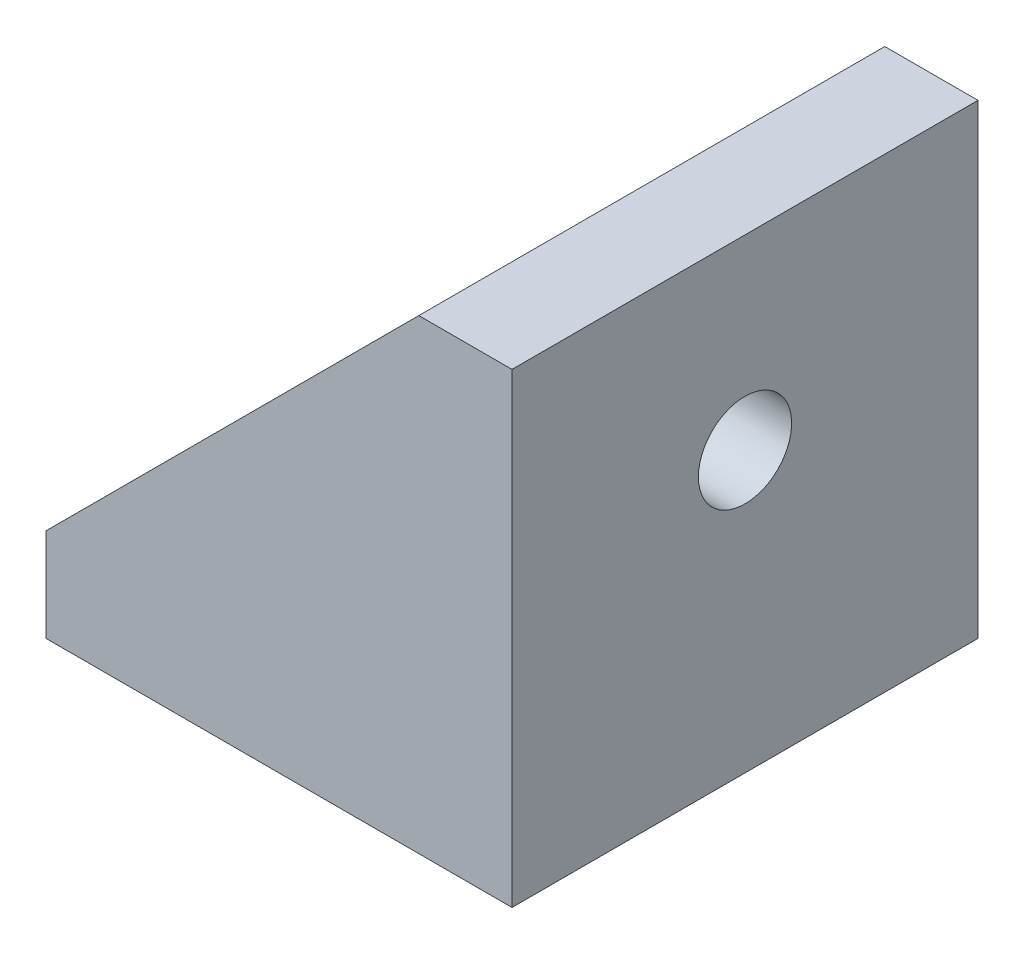
ISO-10303-21;
HEADER;
FILE_DESCRIPTION(('STEP AP214'),'2;1');
FILE_NAME('part.step','',(''),(''),'','','');
FILE_SCHEMA(('AUTOMOTIVE_DESIGN { 1 0 10303 214 1 1 1 1 }'));
ENDSEC;
DATA;
#1=APPLICATION_CONTEXT('core data for automotive mechanical design processes');
#2=APPLICATION_PROTOCOL_DEFINITION('international standard','automotive_design',2000,#1);
#3=PRODUCT_CONTEXT('',#1,'mechanical');
#4=PRODUCT('Part','Part','',(#3));
#5=PRODUCT_RELATED_PRODUCT_CATEGORY('part','',(#4));
#6=PRODUCT_DEFINITION_FORMATION('','',#4);
#7=PRODUCT_DEFINITION_CONTEXT('part definition',#1,'design');
#8=PRODUCT_DEFINITION('design','',#6,#7);
#9=PRODUCT_DEFINITION_SHAPE('','',#8);
#10=(LENGTH_UNIT() NAMED_UNIT(*) SI_UNIT(.MILLI.,.METRE.));
#11=(NAMED_UNIT(*) PLANE_ANGLE_UNIT() SI_UNIT($,.RADIAN.));
#12=(NAMED_UNIT(*) SI_UNIT($,.STERADIAN.) SOLID_ANGLE_UNIT());
#13=UNCERTAINTY_MEASURE_WITH_UNIT(LENGTH_MEASURE(1.E-05),#10,'distance_accuracy_value','');
#14=(GEOMETRIC_REPRESENTATION_CONTEXT(3) GLOBAL_UNCERTAINTY_ASSIGNED_CONTEXT((#13)) GLOBAL_UNIT_ASSIGNED_CONTEXT((#10,
#11,#12)) REPRESENTATION_CONTEXT('',''));
#15=CARTESIAN_POINT('',(0.,0.,0.));
#16=DIRECTION('',(0.,0.,1.));
#17=DIRECTION('',(1.,0.,0.));
#18=AXIS2_PLACEMENT_3D('',#15,#16,#17);
#19=CARTESIAN_POINT('',(-4.,4.,20.));
#20=DIRECTION('',(1.,0.,0.));
#21=DIRECTION('',(0.,0.,-1.));
#22=AXIS2_PLACEMENT_3D('',#19,#20,#21);
#23=PLANE('',#22);
#24=CARTESIAN_POINT('',(-4.,12.,10.));
#25=DIRECTION('',(-1.,0.,0.));
#26=DIRECTION('',(0.,0.,1.));
#27=AXIS2_PLACEMENT_3D('',#24,#25,#26);
#28=CIRCLE('',#27,2.);
#29=CARTESIAN_POINT('',(-4.,12.,12.));
#30=VERTEX_POINT('',#29);
#31=EDGE_CURVE('E173',#30,#30,#28,.T.);
#32=ORIENTED_EDGE('',*,*,#31,.F.);
#33=EDGE_LOOP('',(#32));
#34=FACE_BOUND('',#33,.T.);
#35=DIRECTION('',(0.,0.,-1.));
#36=VECTOR('',#35,1.);
#37=CARTESIAN_POINT('',(-4.,4.,20.));
#38=LINE('',#37,#36);
#39=CARTESIAN_POINT('',(-4.,4.,16.));
#40=VERTEX_POINT('',#39);
#41=CARTESIAN_POINT('',(-4.,4.,4.));
#42=VERTEX_POINT('',#41);
#43=EDGE_CURVE('E57',#40,#42,#38,.T.);
#44=ORIENTED_EDGE('',*,*,#43,.F.);
#45=DIRECTION('',(0.,1.,0.));
#46=VECTOR('',#45,1.);
#47=CARTESIAN_POINT('',(-4.,4.,16.));
#48=LINE('',#47,#46);
#49=CARTESIAN_POINT('',(-4.,20.,16.));
#50=VERTEX_POINT('',#49);
#51=EDGE_CURVE('E111',#40,#50,#48,.T.);
#52=ORIENTED_EDGE('',*,*,#51,.T.);
#53=DIRECTION('',(0.,0.,-1.));
#54=VECTOR('',#53,1.);
#55=CARTESIAN_POINT('',(-4.,20.,20.));
#56=LINE('',#55,#54);
#57=CARTESIAN_POINT('',(-4.,20.,4.));
#58=VERTEX_POINT('',#57);
#59=EDGE_CURVE('E49',#50,#58,#56,.T.);
#60=ORIENTED_EDGE('',*,*,#59,.T.);
#61=DIRECTION('',(0.,-1.,0.));
#62=VECTOR('',#61,1.);
#63=CARTESIAN_POINT('',(-4.,4.,4.));
#64=LINE('',#63,#62);
#65=EDGE_CURVE('E158',#58,#42,#64,.T.);
#66=ORIENTED_EDGE('',*,*,#65,.T.);
#67=EDGE_LOOP('',(#44,#52,#60,#66));
#68=FACE_BOUND('',#67,.T.);
#69=ADVANCED_FACE('F34',(#34,#68),#23,.F.);
#70=CARTESIAN_POINT('',(-20.,4.,20.));
#71=DIRECTION('',(0.,-1.,0.));
#72=DIRECTION('',(0.,0.,-1.));
#73=AXIS2_PLACEMENT_3D('',#70,#71,#72);
#74=PLANE('',#73);
#75=CARTESIAN_POINT('',(-12.,4.,10.));
#76=DIRECTION('',(0.,1.,0.));
#77=DIRECTION('',(0.,0.,1.));
#78=AXIS2_PLACEMENT_3D('',#75,#76,#77);
#79=CIRCLE('',#78,2.);
#80=CARTESIAN_POINT('',(-12.,4.,12.));
#81=VERTEX_POINT('',#80);
#82=EDGE_CURVE('E167',#81,#81,#79,.T.);
#83=ORIENTED_EDGE('',*,*,#82,.F.);
#84=EDGE_LOOP('',(#83));
#85=FACE_BOUND('',#84,.T.);
#86=DIRECTION('',(0.,0.,-1.));
#87=VECTOR('',#86,1.);
#88=CARTESIAN_POINT('',(-20.,4.,20.));
#89=LINE('',#88,#87);
#90=CARTESIAN_POINT('',(-20.,4.,16.));
#91=VERTEX_POINT('',#90);
#92=CARTESIAN_POINT('',(-20.,4.,4.));
#93=VERTEX_POINT('',#92);
#94=EDGE_CURVE('E125',#91,#93,#89,.T.);
#95=ORIENTED_EDGE('',*,*,#94,.F.);
#96=DIRECTION('',(1.,0.,0.));
#97=VECTOR('',#96,1.);
#98=CARTESIAN_POINT('',(-20.,4.,16.));
#99=LINE('',#98,#97);
#100=EDGE_CURVE('E112',#91,#40,#99,.T.);
#101=ORIENTED_EDGE('',*,*,#100,.T.);
#102=ORIENTED_EDGE('',*,*,#43,.T.);
#103=DIRECTION('',(-1.,0.,0.));
#104=VECTOR('',#103,1.);
#105=CARTESIAN_POINT('',(-20.,4.,4.));
#106=LINE('',#105,#104);
#107=EDGE_CURVE('E161',#42,#93,#106,.T.);
#108=ORIENTED_EDGE('',*,*,#107,.T.);
#109=EDGE_LOOP('',(#95,#101,#102,#108));
#110=FACE_BOUND('',#109,.T.);
#111=ADVANCED_FACE('F189',(#85,#110),#74,.F.);
#112=CARTESIAN_POINT('',(0.,20.,20.));
#113=DIRECTION('',(-1.,0.,0.));
#114=DIRECTION('',(0.,0.,1.));
#115=AXIS2_PLACEMENT_3D('',#112,#113,#114);
#116=PLANE('',#115);
#117=CARTESIAN_POINT('',(0.,12.,10.));
#118=DIRECTION('',(-1.,0.,0.));
#119=DIRECTION('',(0.,0.,1.));
#120=AXIS2_PLACEMENT_3D('',#117,#118,#119);
#121=CIRCLE('',#120,2.);
#122=CARTESIAN_POINT('',(0.,12.,12.));
#123=VERTEX_POINT('',#122);
#124=EDGE_CURVE('E170',#123,#123,#121,.T.);
#125=ORIENTED_EDGE('',*,*,#124,.T.);
#126=EDGE_LOOP('',(#125));
#127=FACE_BOUND('',#126,.T.);
#128=DIRECTION('',(0.,1.,0.));
#129=VECTOR('',#128,1.);
#130=CARTESIAN_POINT('',(0.,20.,0.));
#131=LINE('',#130,#129);
#132=CARTESIAN_POINT('',(0.,0.,0.));
#133=VERTEX_POINT('',#132);
#134=CARTESIAN_POINT('',(0.,20.,0.));
#135=VERTEX_POINT('',#134);
#136=EDGE_CURVE('E140',#133,#135,#131,.T.);
#137=ORIENTED_EDGE('',*,*,#136,.T.);
#138=DIRECTION('',(0.,0.,-1.));
#139=VECTOR('',#138,1.);
#140=CARTESIAN_POINT('',(0.,20.,20.));
#141=LINE('',#140,#139);
#142=CARTESIAN_POINT('',(0.,20.,20.));
#143=VERTEX_POINT('',#142);
#144=EDGE_CURVE('E11',#143,#135,#141,.T.);
#145=ORIENTED_EDGE('',*,*,#144,.F.);
#146=DIRECTION('',(0.,1.,0.));
#147=VECTOR('',#146,1.);
#148=CARTESIAN_POINT('',(0.,20.,20.));
#149=LINE('',#148,#147);
#150=CARTESIAN_POINT('',(0.,0.,20.));
#151=VERTEX_POINT('',#150);
#152=EDGE_CURVE('E135',#151,#143,#149,.T.);
#153=ORIENTED_EDGE('',*,*,#152,.F.);
#154=DIRECTION('',(0.,0.,-1.));
#155=VECTOR('',#154,1.);
#156=CARTESIAN_POINT('',(0.,0.,20.));
#157=LINE('',#156,#155);
#158=EDGE_CURVE('E129',#151,#133,#157,.T.);
#159=ORIENTED_EDGE('',*,*,#158,.T.);
#160=EDGE_LOOP('',(#137,#145,#153,#159));
#161=FACE_BOUND('',#160,.T.);
#162=ADVANCED_FACE('F36',(#127,#161),#116,.F.);
#163=CARTESIAN_POINT('',(-4.,20.,20.));
#164=DIRECTION('',(0.,-1.,0.));
#165=DIRECTION('',(0.,0.,-1.));
#166=AXIS2_PLACEMENT_3D('',#163,#164,#165);
#167=PLANE('',#166);
#168=DIRECTION('',(-1.,0.,0.));
#169=VECTOR('',#168,1.);
#170=CARTESIAN_POINT('',(-4.,20.,0.));
#171=LINE('',#170,#169);
#172=CARTESIAN_POINT('',(-4.,20.,0.));
#173=VERTEX_POINT('',#172);
#174=EDGE_CURVE('E138',#135,#173,#171,.T.);
#175=ORIENTED_EDGE('',*,*,#174,.T.);
#176=DIRECTION('',(0.,0.,-1.));
#177=VECTOR('',#176,1.);
#178=CARTESIAN_POINT('',(-4.,20.,4.));
#179=LINE('',#178,#177);
#180=EDGE_CURVE('E118',#58,#173,#179,.T.);
#181=ORIENTED_EDGE('',*,*,#180,.F.);
#182=ORIENTED_EDGE('',*,*,#59,.F.);
#183=CARTESIAN_POINT('',(-4.,20.,20.));
#184=VERTEX_POINT('',#183);
#185=EDGE_CURVE('E42',#184,#50,#56,.T.);
#186=ORIENTED_EDGE('',*,*,#185,.F.);
#187=DIRECTION('',(-1.,0.,0.));
#188=VECTOR('',#187,1.);
#189=CARTESIAN_POINT('',(-4.,20.,20.));
#190=LINE('',#189,#188);
#191=EDGE_CURVE('E146',#143,#184,#190,.T.);
#192=ORIENTED_EDGE('',*,*,#191,.F.);
#193=ORIENTED_EDGE('',*,*,#144,.T.);
#194=EDGE_LOOP('',(#175,#181,#182,#186,#192,#193));
#195=FACE_BOUND('',#194,.T.);
#196=ADVANCED_FACE('F116',(#195),#167,.F.);
#197=CARTESIAN_POINT('',(-20.,0.,20.));
#198=DIRECTION('',(1.,0.,0.));
#199=DIRECTION('',(0.,0.,-1.));
#200=AXIS2_PLACEMENT_3D('',#197,#198,#199);
#201=PLANE('',#200);
#202=DIRECTION('',(0.,-1.,0.));
#203=VECTOR('',#202,1.);
#204=CARTESIAN_POINT('',(-20.,0.,0.));
#205=LINE('',#204,#203);
#206=CARTESIAN_POINT('',(-20.,4.,0.));
#207=VERTEX_POINT('',#206);
#208=CARTESIAN_POINT('',(-20.,0.,0.));
#209=VERTEX_POINT('',#208);
#210=EDGE_CURVE('E136',#207,#209,#205,.T.);
#211=ORIENTED_EDGE('',*,*,#210,.T.);
#212=DIRECTION('',(0.,0.,-1.));
#213=VECTOR('',#212,1.);
#214=CARTESIAN_POINT('',(-20.,0.,20.));
#215=LINE('',#214,#213);
#216=CARTESIAN_POINT('',(-20.,0.,20.));
#217=VERTEX_POINT('',#216);
#218=EDGE_CURVE('E126',#217,#209,#215,.T.);
#219=ORIENTED_EDGE('',*,*,#218,.F.);
#220=DIRECTION('',(0.,-1.,0.));
#221=VECTOR('',#220,1.);
#222=CARTESIAN_POINT('',(-20.,0.,20.));
#223=LINE('',#222,#221);
#224=CARTESIAN_POINT('',(-20.,4.,20.));
#225=VERTEX_POINT('',#224);
#226=EDGE_CURVE('E144',#225,#217,#223,.T.);
#227=ORIENTED_EDGE('',*,*,#226,.F.);
#228=EDGE_CURVE('E120',#225,#91,#89,.T.);
#229=ORIENTED_EDGE('',*,*,#228,.T.);
#230=ORIENTED_EDGE('',*,*,#94,.T.);
#231=DIRECTION('',(0.,0.,-1.));
#232=VECTOR('',#231,1.);
#233=CARTESIAN_POINT('',(-20.,4.,4.));
#234=LINE('',#233,#232);
#235=EDGE_CURVE('E150',#93,#207,#234,.T.);
#236=ORIENTED_EDGE('',*,*,#235,.T.);
#237=EDGE_LOOP('',(#211,#219,#227,#229,#230,#236));
#238=FACE_BOUND('',#237,.T.);
#239=ADVANCED_FACE('F198',(#238),#201,.F.);
#240=CARTESIAN_POINT('',(0.,0.,20.));
#241=DIRECTION('',(0.,1.,0.));
#242=DIRECTION('',(0.,0.,1.));
#243=AXIS2_PLACEMENT_3D('',#240,#241,#242);
#244=PLANE('',#243);
#245=CARTESIAN_POINT('',(-12.,0.,10.));
#246=DIRECTION('',(0.,1.,0.));
#247=DIRECTION('',(0.,0.,1.));
#248=AXIS2_PLACEMENT_3D('',#245,#246,#247);
#249=CIRCLE('',#248,2.);
#250=CARTESIAN_POINT('',(-12.,0.,12.));
#251=VERTEX_POINT('',#250);
#252=EDGE_CURVE('E165',#251,#251,#249,.T.);
#253=ORIENTED_EDGE('',*,*,#252,.T.);
#254=EDGE_LOOP('',(#253));
#255=FACE_BOUND('',#254,.T.);
#256=DIRECTION('',(1.,0.,0.));
#257=VECTOR('',#256,1.);
#258=CARTESIAN_POINT('',(0.,0.,0.));
#259=LINE('',#258,#257);
#260=EDGE_CURVE('E133',#209,#133,#259,.T.);
#261=ORIENTED_EDGE('',*,*,#260,.T.);
#262=ORIENTED_EDGE('',*,*,#158,.F.);
#263=DIRECTION('',(1.,0.,0.));
#264=VECTOR('',#263,1.);
#265=CARTESIAN_POINT('',(0.,0.,20.));
#266=LINE('',#265,#264);
#267=EDGE_CURVE('E132',#217,#151,#266,.T.);
#268=ORIENTED_EDGE('',*,*,#267,.F.);
#269=ORIENTED_EDGE('',*,*,#218,.T.);
#270=EDGE_LOOP('',(#261,#262,#268,#269));
#271=FACE_BOUND('',#270,.T.);
#272=ADVANCED_FACE('F203',(#255,#271),#244,.F.);
#273=CARTESIAN_POINT('',(0.,0.,20.));
#274=DIRECTION('',(0.,0.,-1.));
#275=DIRECTION('',(-1.,0.,0.));
#276=AXIS2_PLACEMENT_3D('',#273,#274,#275);
#277=PLANE('',#276);
#278=ORIENTED_EDGE('',*,*,#152,.T.);
#279=ORIENTED_EDGE('',*,*,#191,.T.);
#280=DIRECTION('',(-0.707106781186548,-0.707106781186548,0.));
#281=VECTOR('',#280,1.);
#282=CARTESIAN_POINT('',(-4.,20.,20.));
#283=LINE('',#282,#281);
#284=EDGE_CURVE('E106',#184,#225,#283,.T.);
#285=ORIENTED_EDGE('',*,*,#284,.T.);
#286=ORIENTED_EDGE('',*,*,#226,.T.);
#287=ORIENTED_EDGE('',*,*,#267,.T.);
#288=EDGE_LOOP('',(#278,#279,#285,#286,#287));
#289=FACE_BOUND('',#288,.T.);
#290=ADVANCED_FACE('F228',(#289),#277,.F.);
#291=CARTESIAN_POINT('',(0.,0.,0.));
#292=DIRECTION('',(0.,0.,-1.));
#293=DIRECTION('',(-1.,0.,0.));
#294=AXIS2_PLACEMENT_3D('',#291,#292,#293);
#295=PLANE('',#294);
#296=ORIENTED_EDGE('',*,*,#136,.F.);
#297=ORIENTED_EDGE('',*,*,#260,.F.);
#298=ORIENTED_EDGE('',*,*,#210,.F.);
#299=DIRECTION('',(0.707106781186548,0.707106781186548,0.));
#300=VECTOR('',#299,1.);
#301=CARTESIAN_POINT('',(-4.,20.,0.));
#302=LINE('',#301,#300);
#303=EDGE_CURVE('E155',#207,#173,#302,.T.);
#304=ORIENTED_EDGE('',*,*,#303,.T.);
#305=ORIENTED_EDGE('',*,*,#174,.F.);
#306=EDGE_LOOP('',(#296,#297,#298,#304,#305));
#307=FACE_BOUND('',#306,.T.);
#308=ADVANCED_FACE('F250',(#307),#295,.T.);
#309=CARTESIAN_POINT('',(-4.,20.,4.));
#310=DIRECTION('',(-0.707106781186547,0.707106781186547,0.));
#311=DIRECTION('',(-0.707106781186548,-0.707106781186548,0.));
#312=AXIS2_PLACEMENT_3D('',#309,#310,#311);
#313=PLANE('',#312);
#314=ORIENTED_EDGE('',*,*,#303,.F.);
#315=ORIENTED_EDGE('',*,*,#235,.F.);
#316=DIRECTION('',(0.707106781186548,0.707106781186548,0.));
#317=VECTOR('',#316,1.);
#318=CARTESIAN_POINT('',(-4.,20.,4.));
#319=LINE('',#318,#317);
#320=EDGE_CURVE('E153',#93,#58,#319,.T.);
#321=ORIENTED_EDGE('',*,*,#320,.T.);
#322=ORIENTED_EDGE('',*,*,#180,.T.);
#323=EDGE_LOOP('',(#314,#315,#321,#322));
#324=FACE_BOUND('',#323,.T.);
#325=ADVANCED_FACE('F256',(#324),#313,.T.);
#326=CARTESIAN_POINT('',(0.,0.,4.));
#327=DIRECTION('',(0.,0.,-1.));
#328=DIRECTION('',(-1.,0.,0.));
#329=AXIS2_PLACEMENT_3D('',#326,#327,#328);
#330=PLANE('',#329);
#331=ORIENTED_EDGE('',*,*,#65,.F.);
#332=ORIENTED_EDGE('',*,*,#320,.F.);
#333=ORIENTED_EDGE('',*,*,#107,.F.);
#334=EDGE_LOOP('',(#331,#332,#333));
#335=FACE_BOUND('',#334,.T.);
#336=ADVANCED_FACE('F267',(#335),#330,.F.);
#337=CARTESIAN_POINT('',(-4.,20.,16.));
#338=DIRECTION('',(-0.707106781186547,0.707106781186547,0.));
#339=DIRECTION('',(-0.707106781186548,-0.707106781186548,0.));
#340=AXIS2_PLACEMENT_3D('',#337,#338,#339);
#341=PLANE('',#340);
#342=ORIENTED_EDGE('',*,*,#284,.F.);
#343=ORIENTED_EDGE('',*,*,#185,.T.);
#344=DIRECTION('',(-0.707106781186548,-0.707106781186548,0.));
#345=VECTOR('',#344,1.);
#346=CARTESIAN_POINT('',(-4.,20.,16.));
#347=LINE('',#346,#345);
#348=EDGE_CURVE('E104',#50,#91,#347,.T.);
#349=ORIENTED_EDGE('',*,*,#348,.T.);
#350=ORIENTED_EDGE('',*,*,#228,.F.);
#351=EDGE_LOOP('',(#342,#343,#349,#350));
#352=FACE_BOUND('',#351,.T.);
#353=ADVANCED_FACE('F102',(#352),#341,.T.);
#354=CARTESIAN_POINT('',(0.,0.,16.));
#355=DIRECTION('',(0.,0.,-1.));
#356=DIRECTION('',(-1.,0.,0.));
#357=AXIS2_PLACEMENT_3D('',#354,#355,#356);
#358=PLANE('',#357);
#359=ORIENTED_EDGE('',*,*,#51,.F.);
#360=ORIENTED_EDGE('',*,*,#100,.F.);
#361=ORIENTED_EDGE('',*,*,#348,.F.);
#362=EDGE_LOOP('',(#359,#360,#361));
#363=FACE_BOUND('',#362,.T.);
#364=ADVANCED_FACE('F110',(#363),#358,.T.);
#365=CARTESIAN_POINT('',(-12.,0.,10.));
#366=DIRECTION('',(0.,1.,0.));
#367=DIRECTION('',(0.,0.,1.));
#368=AXIS2_PLACEMENT_3D('',#365,#366,#367);
#369=CYLINDRICAL_SURFACE('',#368,2.);
#370=ORIENTED_EDGE('',*,*,#252,.F.);
#371=EDGE_LOOP('',(#370));
#372=FACE_BOUND('',#371,.T.);
#373=ORIENTED_EDGE('',*,*,#82,.T.);
#374=EDGE_LOOP('',(#373));
#375=FACE_BOUND('',#374,.T.);
#376=ADVANCED_FACE('F184',(#372,#375),#369,.F.);
#377=CARTESIAN_POINT('',(0.,12.,10.));
#378=DIRECTION('',(-1.,0.,0.));
#379=DIRECTION('',(0.,0.,1.));
#380=AXIS2_PLACEMENT_3D('',#377,#378,#379);
#381=CYLINDRICAL_SURFACE('',#380,2.);
#382=ORIENTED_EDGE('',*,*,#124,.F.);
#383=EDGE_LOOP('',(#382));
#384=FACE_BOUND('',#383,.T.);
#385=ORIENTED_EDGE('',*,*,#31,.T.);
#386=EDGE_LOOP('',(#385));
#387=FACE_BOUND('',#386,.T.);
#388=ADVANCED_FACE('F181',(#384,#387),#381,.F.);
#389=CLOSED_SHELL('',(#69,#111,#162,#196,#239,#272,#290,#308,#325,#336,#353,#364,#376,#388));
#390=MANIFOLD_SOLID_BREP('B2',#389);
#391=ADVANCED_BREP_SHAPE_REPRESENTATION('',(#18,#390),#14);
#392=SHAPE_DEFINITION_REPRESENTATION(#9,#391);
ENDSEC;
END-ISO-10303-21;
